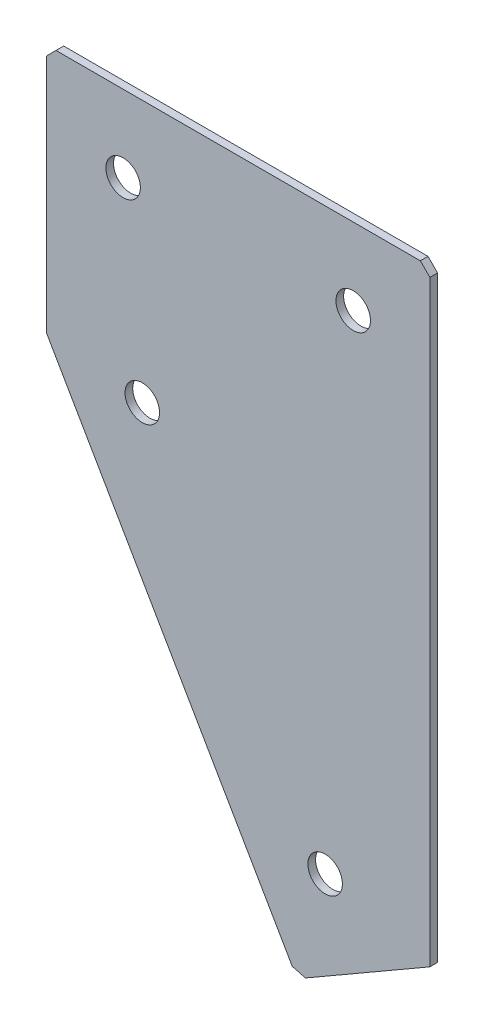
ISO-10303-21;
HEADER;
FILE_DESCRIPTION(('STEP AP214'),'2;1');
FILE_NAME('part.step','',(''),(''),'','','');
FILE_SCHEMA(('AUTOMOTIVE_DESIGN { 1 0 10303 214 1 1 1 1 }'));
ENDSEC;
DATA;
#1=APPLICATION_CONTEXT('core data for automotive mechanical design processes');
#2=APPLICATION_PROTOCOL_DEFINITION('international standard','automotive_design',2000,#1);
#3=PRODUCT_CONTEXT('',#1,'mechanical');
#4=PRODUCT('Part','Part','',(#3));
#5=PRODUCT_RELATED_PRODUCT_CATEGORY('part','',(#4));
#6=PRODUCT_DEFINITION_FORMATION('','',#4);
#7=PRODUCT_DEFINITION_CONTEXT('part definition',#1,'design');
#8=PRODUCT_DEFINITION('design','',#6,#7);
#9=PRODUCT_DEFINITION_SHAPE('','',#8);
#10=(LENGTH_UNIT() NAMED_UNIT(*) SI_UNIT(.MILLI.,.METRE.));
#11=(NAMED_UNIT(*) PLANE_ANGLE_UNIT() SI_UNIT($,.RADIAN.));
#12=(NAMED_UNIT(*) SI_UNIT($,.STERADIAN.) SOLID_ANGLE_UNIT());
#13=UNCERTAINTY_MEASURE_WITH_UNIT(LENGTH_MEASURE(1.E-05),#10,'distance_accuracy_value','');
#14=(GEOMETRIC_REPRESENTATION_CONTEXT(3) GLOBAL_UNCERTAINTY_ASSIGNED_CONTEXT((#13)) GLOBAL_UNIT_ASSIGNED_CONTEXT((#10,
#11,#12)) REPRESENTATION_CONTEXT('',''));
#15=CARTESIAN_POINT('',(0.,0.,0.));
#16=DIRECTION('',(0.,0.,1.));
#17=DIRECTION('',(1.,0.,0.));
#18=AXIS2_PLACEMENT_3D('',#15,#16,#17);
#19=CARTESIAN_POINT('',(0.,0.,-2.));
#20=DIRECTION('',(1.,0.,0.));
#21=DIRECTION('',(0.,0.,-1.));
#22=AXIS2_PLACEMENT_3D('',#19,#20,#21);
#23=PLANE('',#22);
#24=DIRECTION('',(0.,1.,0.));
#25=VECTOR('',#24,1.);
#26=CARTESIAN_POINT('',(0.,0.,0.));
#27=LINE('',#26,#25);
#28=CARTESIAN_POINT('',(0.,-65.,0.));
#29=VERTEX_POINT('',#28);
#30=CARTESIAN_POINT('',(0.,-2.5,0.));
#31=VERTEX_POINT('',#30);
#32=EDGE_CURVE('E137',#29,#31,#27,.T.);
#33=ORIENTED_EDGE('',*,*,#32,.T.);
#34=DIRECTION('',(0.,0.,-1.));
#35=VECTOR('',#34,1.);
#36=CARTESIAN_POINT('',(0.,-2.5,-2.));
#37=LINE('',#36,#35);
#38=CARTESIAN_POINT('',(0.,-2.5,-2.));
#39=VERTEX_POINT('',#38);
#40=EDGE_CURVE('E11',#31,#39,#37,.T.);
#41=ORIENTED_EDGE('',*,*,#40,.T.);
#42=DIRECTION('',(0.,1.,0.));
#43=VECTOR('',#42,1.);
#44=CARTESIAN_POINT('',(0.,0.,-2.));
#45=LINE('',#44,#43);
#46=CARTESIAN_POINT('',(0.,-65.,-2.));
#47=VERTEX_POINT('',#46);
#48=EDGE_CURVE('E153',#47,#39,#45,.T.);
#49=ORIENTED_EDGE('',*,*,#48,.F.);
#50=DIRECTION('',(0.,0.,1.));
#51=VECTOR('',#50,1.);
#52=CARTESIAN_POINT('',(0.,-65.,-2.));
#53=LINE('',#52,#51);
#54=EDGE_CURVE('E125',#47,#29,#53,.T.);
#55=ORIENTED_EDGE('',*,*,#54,.T.);
#56=EDGE_LOOP('',(#33,#41,#49,#55));
#57=FACE_BOUND('',#56,.T.);
#58=ADVANCED_FACE('F39',(#57),#23,.F.);
#59=CARTESIAN_POINT('',(0.,0.,-2.));
#60=DIRECTION('',(0.,-1.,0.));
#61=DIRECTION('',(0.,0.,-1.));
#62=AXIS2_PLACEMENT_3D('',#59,#60,#61);
#63=PLANE('',#62);
#64=DIRECTION('',(1.,0.,0.));
#65=VECTOR('',#64,1.);
#66=CARTESIAN_POINT('',(0.,0.,0.));
#67=LINE('',#66,#65);
#68=CARTESIAN_POINT('',(2.5,0.,0.));
#69=VERTEX_POINT('',#68);
#70=CARTESIAN_POINT('',(97.5,0.,0.));
#71=VERTEX_POINT('',#70);
#72=EDGE_CURVE('E141',#69,#71,#67,.T.);
#73=ORIENTED_EDGE('',*,*,#72,.T.);
#74=DIRECTION('',(0.,0.,-1.));
#75=VECTOR('',#74,1.);
#76=CARTESIAN_POINT('',(97.5,0.,-2.));
#77=LINE('',#76,#75);
#78=CARTESIAN_POINT('',(97.5,0.,-2.));
#79=VERTEX_POINT('',#78);
#80=EDGE_CURVE('E48',#71,#79,#77,.T.);
#81=ORIENTED_EDGE('',*,*,#80,.T.);
#82=DIRECTION('',(1.,0.,0.));
#83=VECTOR('',#82,1.);
#84=CARTESIAN_POINT('',(0.,0.,-2.));
#85=LINE('',#84,#83);
#86=CARTESIAN_POINT('',(2.5,0.,-2.));
#87=VERTEX_POINT('',#86);
#88=EDGE_CURVE('E113',#87,#79,#85,.T.);
#89=ORIENTED_EDGE('',*,*,#88,.F.);
#90=DIRECTION('',(0.,0.,1.));
#91=VECTOR('',#90,1.);
#92=CARTESIAN_POINT('',(2.5,0.,-2.));
#93=LINE('',#92,#91);
#94=EDGE_CURVE('E182',#87,#69,#93,.T.);
#95=ORIENTED_EDGE('',*,*,#94,.T.);
#96=EDGE_LOOP('',(#73,#81,#89,#95));
#97=FACE_BOUND('',#96,.T.);
#98=ADVANCED_FACE('F188',(#97),#63,.F.);
#99=CARTESIAN_POINT('',(100.,0.,-2.));
#100=DIRECTION('',(-1.,0.,0.));
#101=DIRECTION('',(0.,0.,1.));
#102=AXIS2_PLACEMENT_3D('',#99,#100,#101);
#103=PLANE('',#102);
#104=DIRECTION('',(0.,-1.,0.));
#105=VECTOR('',#104,1.);
#106=CARTESIAN_POINT('',(100.,0.,-2.));
#107=LINE('',#106,#105);
#108=CARTESIAN_POINT('',(100.,-2.5,-2.));
#109=VERTEX_POINT('',#108);
#110=CARTESIAN_POINT('',(100.,-158.205080756888,-2.));
#111=VERTEX_POINT('',#110);
#112=EDGE_CURVE('E103',#109,#111,#107,.T.);
#113=ORIENTED_EDGE('',*,*,#112,.F.);
#114=DIRECTION('',(0.,0.,1.));
#115=VECTOR('',#114,1.);
#116=CARTESIAN_POINT('',(100.,-2.5,-2.));
#117=LINE('',#116,#115);
#118=CARTESIAN_POINT('',(100.,-2.5,0.));
#119=VERTEX_POINT('',#118);
#120=EDGE_CURVE('E179',#109,#119,#117,.T.);
#121=ORIENTED_EDGE('',*,*,#120,.T.);
#122=DIRECTION('',(0.,-1.,0.));
#123=VECTOR('',#122,1.);
#124=CARTESIAN_POINT('',(100.,0.,0.));
#125=LINE('',#124,#123);
#126=CARTESIAN_POINT('',(100.,-158.205080756888,0.));
#127=VERTEX_POINT('',#126);
#128=EDGE_CURVE('E119',#119,#127,#125,.T.);
#129=ORIENTED_EDGE('',*,*,#128,.T.);
#130=DIRECTION('',(0.,0.,1.));
#131=VECTOR('',#130,1.);
#132=CARTESIAN_POINT('',(100.,-158.205080756888,-2.));
#133=LINE('',#132,#131);
#134=EDGE_CURVE('E116',#111,#127,#133,.T.);
#135=ORIENTED_EDGE('',*,*,#134,.F.);
#136=EDGE_LOOP('',(#113,#121,#129,#135));
#137=FACE_BOUND('',#136,.T.);
#138=ADVANCED_FACE('F117',(#137),#103,.F.);
#139=CARTESIAN_POINT('',(65.3589838486224,-178.205080756888,-2.));
#140=DIRECTION('',(-0.499999999999998,0.86602540378444,0.));
#141=DIRECTION('',(-0.86602540378444,-0.499999999999998,0.));
#142=AXIS2_PLACEMENT_3D('',#139,#140,#141);
#143=PLANE('',#142);
#144=DIRECTION('',(-0.86602540378444,-0.499999999999998,0.));
#145=VECTOR('',#144,1.);
#146=CARTESIAN_POINT('',(65.3589838486224,-178.205080756888,0.));
#147=LINE('',#146,#145);
#148=CARTESIAN_POINT('',(67.5240473580835,-176.955080756888,0.));
#149=VERTEX_POINT('',#148);
#150=EDGE_CURVE('E147',#127,#149,#147,.T.);
#151=ORIENTED_EDGE('',*,*,#150,.T.);
#152=DIRECTION('',(0.,0.,-1.));
#153=VECTOR('',#152,1.);
#154=CARTESIAN_POINT('',(67.5240473580835,-176.955080756888,-2.));
#155=LINE('',#154,#153);
#156=CARTESIAN_POINT('',(67.5240473580835,-176.955080756888,-2.));
#157=VERTEX_POINT('',#156);
#158=EDGE_CURVE('E129',#149,#157,#155,.T.);
#159=ORIENTED_EDGE('',*,*,#158,.T.);
#160=DIRECTION('',(-0.86602540378444,-0.499999999999998,0.));
#161=VECTOR('',#160,1.);
#162=CARTESIAN_POINT('',(65.3589838486224,-178.205080756888,-2.));
#163=LINE('',#162,#161);
#164=EDGE_CURVE('E107',#111,#157,#163,.T.);
#165=ORIENTED_EDGE('',*,*,#164,.F.);
#166=ORIENTED_EDGE('',*,*,#134,.T.);
#167=EDGE_LOOP('',(#151,#159,#165,#166));
#168=FACE_BOUND('',#167,.T.);
#169=ADVANCED_FACE('F127',(#168),#143,.F.);
#170=CARTESIAN_POINT('',(0.,-65.,-2.));
#171=DIRECTION('',(0.86602540378444,0.499999999999998,0.));
#172=DIRECTION('',(-0.499999999999998,0.86602540378444,0.));
#173=AXIS2_PLACEMENT_3D('',#170,#171,#172);
#174=PLANE('',#173);
#175=DIRECTION('',(-0.499999999999998,0.86602540378444,0.));
#176=VECTOR('',#175,1.);
#177=CARTESIAN_POINT('',(0.,-65.,-2.));
#178=LINE('',#177,#176);
#179=CARTESIAN_POINT('',(64.1089838486224,-176.040017247427,-2.));
#180=VERTEX_POINT('',#179);
#181=EDGE_CURVE('E131',#180,#47,#178,.T.);
#182=ORIENTED_EDGE('',*,*,#181,.F.);
#183=DIRECTION('',(0.,0.,1.));
#184=VECTOR('',#183,1.);
#185=CARTESIAN_POINT('',(64.1089838486224,-176.040017247427,-2.));
#186=LINE('',#185,#184);
#187=CARTESIAN_POINT('',(64.1089838486224,-176.040017247427,0.));
#188=VERTEX_POINT('',#187);
#189=EDGE_CURVE('E124',#180,#188,#186,.T.);
#190=ORIENTED_EDGE('',*,*,#189,.T.);
#191=DIRECTION('',(-0.499999999999998,0.86602540378444,0.));
#192=VECTOR('',#191,1.);
#193=CARTESIAN_POINT('',(0.,-65.,0.));
#194=LINE('',#193,#192);
#195=EDGE_CURVE('E150',#188,#29,#194,.T.);
#196=ORIENTED_EDGE('',*,*,#195,.T.);
#197=ORIENTED_EDGE('',*,*,#54,.F.);
#198=EDGE_LOOP('',(#182,#190,#196,#197));
#199=FACE_BOUND('',#198,.T.);
#200=ADVANCED_FACE('F218',(#199),#174,.F.);
#201=CARTESIAN_POINT('',(0.,0.,-2.));
#202=DIRECTION('',(0.,0.,1.));
#203=DIRECTION('',(1.,0.,0.));
#204=AXIS2_PLACEMENT_3D('',#201,#202,#203);
#205=PLANE('',#204);
#206=CARTESIAN_POINT('',(20.,-20.,-2.));
#207=DIRECTION('',(0.,0.,-1.));
#208=DIRECTION('',(0.,1.,0.));
#209=AXIS2_PLACEMENT_3D('',#206,#207,#208);
#210=CIRCLE('',#209,4.5);
#211=CARTESIAN_POINT('',(20.,-15.5,-2.));
#212=VERTEX_POINT('',#211);
#213=EDGE_CURVE('E250',#212,#212,#210,.T.);
#214=ORIENTED_EDGE('',*,*,#213,.F.);
#215=EDGE_LOOP('',(#214));
#216=FACE_BOUND('',#215,.T.);
#217=CARTESIAN_POINT('',(80.,-20.,-2.));
#218=DIRECTION('',(0.,0.,-1.));
#219=DIRECTION('',(0.,1.,0.));
#220=AXIS2_PLACEMENT_3D('',#217,#218,#219);
#221=CIRCLE('',#220,4.5);
#222=CARTESIAN_POINT('',(80.,-15.5,-2.));
#223=VERTEX_POINT('',#222);
#224=EDGE_CURVE('E254',#223,#223,#221,.T.);
#225=ORIENTED_EDGE('',*,*,#224,.F.);
#226=EDGE_LOOP('',(#225));
#227=FACE_BOUND('',#226,.T.);
#228=CARTESIAN_POINT('',(25.,-68.3012701892226,-2.));
#229=DIRECTION('',(0.,0.,-1.));
#230=DIRECTION('',(0.,1.,0.));
#231=AXIS2_PLACEMENT_3D('',#228,#229,#230);
#232=CIRCLE('',#231,4.5);
#233=CARTESIAN_POINT('',(25.,-63.8012701892226,-2.));
#234=VERTEX_POINT('',#233);
#235=EDGE_CURVE('E264',#234,#234,#232,.T.);
#236=ORIENTED_EDGE('',*,*,#235,.F.);
#237=EDGE_LOOP('',(#236));
#238=FACE_BOUND('',#237,.T.);
#239=CARTESIAN_POINT('',(72.6794919243112,-150.8845726812,-2.00000000000001));
#240=DIRECTION('',(0.,0.,-1.));
#241=DIRECTION('',(0.,1.,0.));
#242=AXIS2_PLACEMENT_3D('',#239,#240,#241);
#243=CIRCLE('',#242,4.5);
#244=CARTESIAN_POINT('',(72.6794919243112,-146.3845726812,-2.00000000000001));
#245=VERTEX_POINT('',#244);
#246=EDGE_CURVE('E272',#245,#245,#243,.T.);
#247=ORIENTED_EDGE('',*,*,#246,.F.);
#248=EDGE_LOOP('',(#247));
#249=FACE_BOUND('',#248,.T.);
#250=ORIENTED_EDGE('',*,*,#164,.T.);
#251=DIRECTION('',(0.965925826289068,-0.258819045102521,0.));
#252=VECTOR('',#251,1.);
#253=CARTESIAN_POINT('',(64.1089838486224,-176.040017247427,-2.));
#254=LINE('',#253,#252);
#255=EDGE_CURVE('E176',#157,#180,#254,.F.);
#256=ORIENTED_EDGE('',*,*,#255,.T.);
#257=ORIENTED_EDGE('',*,*,#181,.T.);
#258=ORIENTED_EDGE('',*,*,#48,.T.);
#259=DIRECTION('',(-0.707106781186548,-0.707106781186548,0.));
#260=VECTOR('',#259,1.);
#261=CARTESIAN_POINT('',(2.5,0.,-2.));
#262=LINE('',#261,#260);
#263=EDGE_CURVE('E171',#39,#87,#262,.F.);
#264=ORIENTED_EDGE('',*,*,#263,.T.);
#265=ORIENTED_EDGE('',*,*,#88,.T.);
#266=DIRECTION('',(-0.707106781186548,0.707106781186548,0.));
#267=VECTOR('',#266,1.);
#268=CARTESIAN_POINT('',(100.,-2.5,-2.));
#269=LINE('',#268,#267);
#270=EDGE_CURVE('E55',#79,#109,#269,.F.);
#271=ORIENTED_EDGE('',*,*,#270,.T.);
#272=ORIENTED_EDGE('',*,*,#112,.T.);
#273=EDGE_LOOP('',(#250,#256,#257,#258,#264,#265,#271,#272));
#274=FACE_BOUND('',#273,.T.);
#275=ADVANCED_FACE('F105',(#216,#227,#238,#249,#274),#205,.F.);
#276=CARTESIAN_POINT('',(0.,0.,0.));
#277=DIRECTION('',(0.,0.,1.));
#278=DIRECTION('',(1.,0.,0.));
#279=AXIS2_PLACEMENT_3D('',#276,#277,#278);
#280=PLANE('',#279);
#281=CARTESIAN_POINT('',(20.,-20.,0.));
#282=DIRECTION('',(0.,0.,-1.));
#283=DIRECTION('',(0.,1.,0.));
#284=AXIS2_PLACEMENT_3D('',#281,#282,#283);
#285=CIRCLE('',#284,4.5);
#286=CARTESIAN_POINT('',(20.,-15.5,0.));
#287=VERTEX_POINT('',#286);
#288=EDGE_CURVE('E247',#287,#287,#285,.T.);
#289=ORIENTED_EDGE('',*,*,#288,.T.);
#290=EDGE_LOOP('',(#289));
#291=FACE_BOUND('',#290,.T.);
#292=CARTESIAN_POINT('',(80.,-20.,0.));
#293=DIRECTION('',(0.,0.,-1.));
#294=DIRECTION('',(0.,1.,0.));
#295=AXIS2_PLACEMENT_3D('',#292,#293,#294);
#296=CIRCLE('',#295,4.5);
#297=CARTESIAN_POINT('',(80.,-15.5,0.));
#298=VERTEX_POINT('',#297);
#299=EDGE_CURVE('E260',#298,#298,#296,.T.);
#300=ORIENTED_EDGE('',*,*,#299,.T.);
#301=EDGE_LOOP('',(#300));
#302=FACE_BOUND('',#301,.T.);
#303=CARTESIAN_POINT('',(25.,-68.3012701892226,0.));
#304=DIRECTION('',(0.,0.,-1.));
#305=DIRECTION('',(0.,1.,0.));
#306=AXIS2_PLACEMENT_3D('',#303,#304,#305);
#307=CIRCLE('',#306,4.5);
#308=CARTESIAN_POINT('',(25.,-63.8012701892226,0.));
#309=VERTEX_POINT('',#308);
#310=EDGE_CURVE('E268',#309,#309,#307,.T.);
#311=ORIENTED_EDGE('',*,*,#310,.T.);
#312=EDGE_LOOP('',(#311));
#313=FACE_BOUND('',#312,.T.);
#314=CARTESIAN_POINT('',(72.6794919243112,-150.8845726812,0.));
#315=DIRECTION('',(0.,0.,-1.));
#316=DIRECTION('',(0.,1.,0.));
#317=AXIS2_PLACEMENT_3D('',#314,#315,#316);
#318=CIRCLE('',#317,4.5);
#319=CARTESIAN_POINT('',(72.6794919243112,-146.3845726812,0.));
#320=VERTEX_POINT('',#319);
#321=EDGE_CURVE('E142',#320,#320,#318,.T.);
#322=ORIENTED_EDGE('',*,*,#321,.T.);
#323=EDGE_LOOP('',(#322));
#324=FACE_BOUND('',#323,.T.);
#325=ORIENTED_EDGE('',*,*,#195,.F.);
#326=DIRECTION('',(-0.965925826289068,0.258819045102521,0.));
#327=VECTOR('',#326,1.);
#328=CARTESIAN_POINT('',(-39.7155166994023,-148.220326171019,0.));
#329=LINE('',#328,#327);
#330=EDGE_CURVE('E166',#188,#149,#329,.F.);
#331=ORIENTED_EDGE('',*,*,#330,.T.);
#332=ORIENTED_EDGE('',*,*,#150,.F.);
#333=ORIENTED_EDGE('',*,*,#128,.F.);
#334=DIRECTION('',(0.707106781186548,-0.707106781186548,0.));
#335=VECTOR('',#334,1.);
#336=CARTESIAN_POINT('',(48.75,48.75,0.));
#337=LINE('',#336,#335);
#338=EDGE_CURVE('E163',#119,#71,#337,.F.);
#339=ORIENTED_EDGE('',*,*,#338,.T.);
#340=ORIENTED_EDGE('',*,*,#72,.F.);
#341=DIRECTION('',(0.707106781186548,0.707106781186548,0.));
#342=VECTOR('',#341,1.);
#343=CARTESIAN_POINT('',(1.25,-1.25,0.));
#344=LINE('',#343,#342);
#345=EDGE_CURVE('E160',#69,#31,#344,.F.);
#346=ORIENTED_EDGE('',*,*,#345,.T.);
#347=ORIENTED_EDGE('',*,*,#32,.F.);
#348=EDGE_LOOP('',(#325,#331,#332,#333,#339,#340,#346,#347));
#349=FACE_BOUND('',#348,.T.);
#350=ADVANCED_FACE('F193',(#291,#302,#313,#324,#349),#280,.T.);
#351=CARTESIAN_POINT('',(72.6794919243112,-150.8845726812,-2.00000000000001));
#352=DIRECTION('',(0.,0.,-1.));
#353=DIRECTION('',(0.,1.,0.));
#354=AXIS2_PLACEMENT_3D('',#351,#352,#353);
#355=CYLINDRICAL_SURFACE('',#354,4.5);
#356=ORIENTED_EDGE('',*,*,#321,.F.);
#357=EDGE_LOOP('',(#356));
#358=FACE_BOUND('',#357,.T.);
#359=ORIENTED_EDGE('',*,*,#246,.T.);
#360=EDGE_LOOP('',(#359));
#361=FACE_BOUND('',#360,.T.);
#362=ADVANCED_FACE('F224',(#358,#361),#355,.F.);
#363=CARTESIAN_POINT('',(25.,-68.3012701892226,-2.));
#364=DIRECTION('',(0.,0.,-1.));
#365=DIRECTION('',(0.,1.,0.));
#366=AXIS2_PLACEMENT_3D('',#363,#364,#365);
#367=CYLINDRICAL_SURFACE('',#366,4.5);
#368=ORIENTED_EDGE('',*,*,#310,.F.);
#369=EDGE_LOOP('',(#368));
#370=FACE_BOUND('',#369,.T.);
#371=ORIENTED_EDGE('',*,*,#235,.T.);
#372=EDGE_LOOP('',(#371));
#373=FACE_BOUND('',#372,.T.);
#374=ADVANCED_FACE('F231',(#370,#373),#367,.F.);
#375=CARTESIAN_POINT('',(80.,-20.,-2.));
#376=DIRECTION('',(0.,0.,-1.));
#377=DIRECTION('',(0.,1.,0.));
#378=AXIS2_PLACEMENT_3D('',#375,#376,#377);
#379=CYLINDRICAL_SURFACE('',#378,4.5);
#380=ORIENTED_EDGE('',*,*,#299,.F.);
#381=EDGE_LOOP('',(#380));
#382=FACE_BOUND('',#381,.T.);
#383=ORIENTED_EDGE('',*,*,#224,.T.);
#384=EDGE_LOOP('',(#383));
#385=FACE_BOUND('',#384,.T.);
#386=ADVANCED_FACE('F235',(#382,#385),#379,.F.);
#387=CARTESIAN_POINT('',(20.,-20.,-2.));
#388=DIRECTION('',(0.,0.,-1.));
#389=DIRECTION('',(0.,1.,0.));
#390=AXIS2_PLACEMENT_3D('',#387,#388,#389);
#391=CYLINDRICAL_SURFACE('',#390,4.5);
#392=ORIENTED_EDGE('',*,*,#288,.F.);
#393=EDGE_LOOP('',(#392));
#394=FACE_BOUND('',#393,.T.);
#395=ORIENTED_EDGE('',*,*,#213,.T.);
#396=EDGE_LOOP('',(#395));
#397=FACE_BOUND('',#396,.T.);
#398=ADVANCED_FACE('F203',(#394,#397),#391,.F.);
#399=CARTESIAN_POINT('',(64.1089838486224,-176.040017247427,-2.));
#400=DIRECTION('',(0.258819045102521,0.965925826289068,0.));
#401=DIRECTION('',(0.,0.,1.));
#402=AXIS2_PLACEMENT_3D('',#399,#400,#401);
#403=PLANE('',#402);
#404=ORIENTED_EDGE('',*,*,#255,.F.);
#405=ORIENTED_EDGE('',*,*,#158,.F.);
#406=ORIENTED_EDGE('',*,*,#330,.F.);
#407=ORIENTED_EDGE('',*,*,#189,.F.);
#408=EDGE_LOOP('',(#404,#405,#406,#407));
#409=FACE_BOUND('',#408,.T.);
#410=ADVANCED_FACE('F198',(#409),#403,.F.);
#411=CARTESIAN_POINT('',(100.,-2.5,-2.));
#412=DIRECTION('',(-0.707106781186547,-0.707106781186547,0.));
#413=DIRECTION('',(0.,0.,1.));
#414=AXIS2_PLACEMENT_3D('',#411,#412,#413);
#415=PLANE('',#414);
#416=ORIENTED_EDGE('',*,*,#270,.F.);
#417=ORIENTED_EDGE('',*,*,#80,.F.);
#418=ORIENTED_EDGE('',*,*,#338,.F.);
#419=ORIENTED_EDGE('',*,*,#120,.F.);
#420=EDGE_LOOP('',(#416,#417,#418,#419));
#421=FACE_BOUND('',#420,.T.);
#422=ADVANCED_FACE('F196',(#421),#415,.F.);
#423=CARTESIAN_POINT('',(2.5,0.,-2.));
#424=DIRECTION('',(0.707106781186547,-0.707106781186547,0.));
#425=DIRECTION('',(0.,0.,1.));
#426=AXIS2_PLACEMENT_3D('',#423,#424,#425);
#427=PLANE('',#426);
#428=ORIENTED_EDGE('',*,*,#263,.F.);
#429=ORIENTED_EDGE('',*,*,#40,.F.);
#430=ORIENTED_EDGE('',*,*,#345,.F.);
#431=ORIENTED_EDGE('',*,*,#94,.F.);
#432=EDGE_LOOP('',(#428,#429,#430,#431));
#433=FACE_BOUND('',#432,.T.);
#434=ADVANCED_FACE('F41',(#433),#427,.F.);
#435=CLOSED_SHELL('',(#58,#98,#138,#169,#200,#275,#350,#362,#374,#386,#398,#410,#422,#434));
#436=MANIFOLD_SOLID_BREP('B2',#435);
#437=ADVANCED_BREP_SHAPE_REPRESENTATION('',(#18,#436),#14);
#438=SHAPE_DEFINITION_REPRESENTATION(#9,#437);
ENDSEC;
END-ISO-10303-21;
